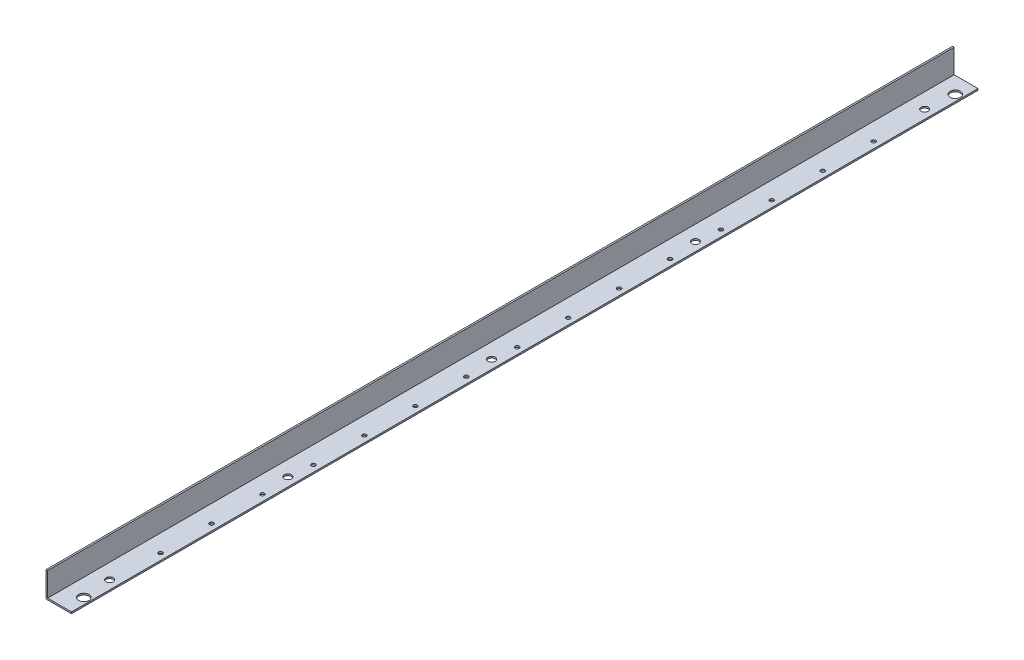
ISO-10303-21;
HEADER;
FILE_DESCRIPTION(('STEP AP214'),'2;1');
FILE_NAME('part.step','',(''),(''),'','','');
FILE_SCHEMA(('AUTOMOTIVE_DESIGN { 1 0 10303 214 1 1 1 1 }'));
ENDSEC;
DATA;
#1=APPLICATION_CONTEXT('core data for automotive mechanical design processes');
#2=APPLICATION_PROTOCOL_DEFINITION('international standard','automotive_design',2000,#1);
#3=PRODUCT_CONTEXT('',#1,'mechanical');
#4=PRODUCT('Part','Part','',(#3));
#5=PRODUCT_RELATED_PRODUCT_CATEGORY('part','',(#4));
#6=PRODUCT_DEFINITION_FORMATION('','',#4);
#7=PRODUCT_DEFINITION_CONTEXT('part definition',#1,'design');
#8=PRODUCT_DEFINITION('design','',#6,#7);
#9=PRODUCT_DEFINITION_SHAPE('','',#8);
#10=(LENGTH_UNIT() NAMED_UNIT(*) SI_UNIT(.MILLI.,.METRE.));
#11=(NAMED_UNIT(*) PLANE_ANGLE_UNIT() SI_UNIT($,.RADIAN.));
#12=(NAMED_UNIT(*) SI_UNIT($,.STERADIAN.) SOLID_ANGLE_UNIT());
#13=UNCERTAINTY_MEASURE_WITH_UNIT(LENGTH_MEASURE(1.E-05),#10,'distance_accuracy_value','');
#14=(GEOMETRIC_REPRESENTATION_CONTEXT(3) GLOBAL_UNCERTAINTY_ASSIGNED_CONTEXT((#13)) GLOBAL_UNIT_ASSIGNED_CONTEXT((#10,
#11,#12)) REPRESENTATION_CONTEXT('',''));
#15=CARTESIAN_POINT('',(0.,0.,0.));
#16=DIRECTION('',(0.,0.,1.));
#17=DIRECTION('',(1.,0.,0.));
#18=AXIS2_PLACEMENT_3D('',#15,#16,#17);
#19=CARTESIAN_POINT('',(38.1,0.,866.775));
#20=DIRECTION('',(0.,1.,0.));
#21=DIRECTION('',(0.,0.,1.));
#22=AXIS2_PLACEMENT_3D('',#19,#20,#21);
#23=CYLINDRICAL_SURFACE('',#22,10.31875);
#24=CARTESIAN_POINT('',(38.1,3.175,866.775));
#25=DIRECTION('',(0.,1.,0.));
#26=DIRECTION('',(0.,0.,1.));
#27=AXIS2_PLACEMENT_3D('',#24,#25,#26);
#28=CIRCLE('',#27,10.31875);
#29=CARTESIAN_POINT('',(38.1,3.175,877.09375));
#30=VERTEX_POINT('',#29);
#31=EDGE_CURVE('E19',#30,#30,#28,.F.);
#32=ORIENTED_EDGE('',*,*,#31,.F.);
#33=EDGE_LOOP('',(#32));
#34=FACE_BOUND('',#33,.T.);
#35=CARTESIAN_POINT('',(38.1,0.,866.775));
#36=DIRECTION('',(0.,1.,0.));
#37=DIRECTION('',(0.,0.,1.));
#38=AXIS2_PLACEMENT_3D('',#35,#36,#37);
#39=CIRCLE('',#38,10.31875);
#40=CARTESIAN_POINT('',(38.1,0.,877.09375));
#41=VERTEX_POINT('',#40);
#42=EDGE_CURVE('E100',#41,#41,#39,.T.);
#43=ORIENTED_EDGE('',*,*,#42,.F.);
#44=EDGE_LOOP('',(#43));
#45=FACE_BOUND('',#44,.T.);
#46=ADVANCED_FACE('F16',(#34,#45),#23,.F.);
#47=CARTESIAN_POINT('',(38.1,0.,-871.5375));
#48=DIRECTION('',(0.,1.,0.));
#49=DIRECTION('',(0.,0.,1.));
#50=AXIS2_PLACEMENT_3D('',#47,#48,#49);
#51=CYLINDRICAL_SURFACE('',#50,10.31875);
#52=CARTESIAN_POINT('',(38.1,3.175,-871.5375));
#53=DIRECTION('',(0.,1.,0.));
#54=DIRECTION('',(0.,0.,1.));
#55=AXIS2_PLACEMENT_3D('',#52,#53,#54);
#56=CIRCLE('',#55,10.31875);
#57=CARTESIAN_POINT('',(38.1,3.175,-861.21875));
#58=VERTEX_POINT('',#57);
#59=EDGE_CURVE('E222',#58,#58,#56,.F.);
#60=ORIENTED_EDGE('',*,*,#59,.F.);
#61=EDGE_LOOP('',(#60));
#62=FACE_BOUND('',#61,.T.);
#63=CARTESIAN_POINT('',(38.1,0.,-871.5375));
#64=DIRECTION('',(0.,1.,0.));
#65=DIRECTION('',(0.,0.,1.));
#66=AXIS2_PLACEMENT_3D('',#63,#64,#65);
#67=CIRCLE('',#66,10.31875);
#68=CARTESIAN_POINT('',(38.1,0.,-861.21875));
#69=VERTEX_POINT('',#68);
#70=EDGE_CURVE('E159',#69,#69,#67,.T.);
#71=ORIENTED_EDGE('',*,*,#70,.F.);
#72=EDGE_LOOP('',(#71));
#73=FACE_BOUND('',#72,.T.);
#74=ADVANCED_FACE('F232',(#62,#73),#51,.F.);
#75=CARTESIAN_POINT('',(33.3375,0.,810.41875));
#76=DIRECTION('',(0.,1.,0.));
#77=DIRECTION('',(0.,0.,1.));
#78=AXIS2_PLACEMENT_3D('',#75,#76,#77);
#79=CYLINDRICAL_SURFACE('',#78,7.14375);
#80=CARTESIAN_POINT('',(33.3375,3.175,810.41875));
#81=DIRECTION('',(0.,1.,0.));
#82=DIRECTION('',(0.,0.,1.));
#83=AXIS2_PLACEMENT_3D('',#80,#81,#82);
#84=CIRCLE('',#83,7.14375);
#85=CARTESIAN_POINT('',(33.3375,3.175,817.5625));
#86=VERTEX_POINT('',#85);
#87=EDGE_CURVE('E220',#86,#86,#84,.F.);
#88=ORIENTED_EDGE('',*,*,#87,.F.);
#89=EDGE_LOOP('',(#88));
#90=FACE_BOUND('',#89,.T.);
#91=CARTESIAN_POINT('',(33.3375,0.,810.41875));
#92=DIRECTION('',(0.,1.,0.));
#93=DIRECTION('',(0.,0.,1.));
#94=AXIS2_PLACEMENT_3D('',#91,#92,#93);
#95=CIRCLE('',#94,7.14375);
#96=CARTESIAN_POINT('',(33.3375,0.,817.5625));
#97=VERTEX_POINT('',#96);
#98=EDGE_CURVE('E156',#97,#97,#95,.T.);
#99=ORIENTED_EDGE('',*,*,#98,.F.);
#100=EDGE_LOOP('',(#99));
#101=FACE_BOUND('',#100,.T.);
#102=ADVANCED_FACE('F526',(#90,#101),#79,.F.);
#103=CARTESIAN_POINT('',(33.3375,0.,454.81875));
#104=DIRECTION('',(0.,1.,0.));
#105=DIRECTION('',(0.,0.,1.));
#106=AXIS2_PLACEMENT_3D('',#103,#104,#105);
#107=CYLINDRICAL_SURFACE('',#106,7.14375);
#108=CARTESIAN_POINT('',(33.3375,3.175,454.81875));
#109=DIRECTION('',(0.,1.,0.));
#110=DIRECTION('',(0.,0.,1.));
#111=AXIS2_PLACEMENT_3D('',#108,#109,#110);
#112=CIRCLE('',#111,7.14375);
#113=CARTESIAN_POINT('',(33.3375,3.175,461.9625));
#114=VERTEX_POINT('',#113);
#115=EDGE_CURVE('E217',#114,#114,#112,.F.);
#116=ORIENTED_EDGE('',*,*,#115,.F.);
#117=EDGE_LOOP('',(#116));
#118=FACE_BOUND('',#117,.T.);
#119=CARTESIAN_POINT('',(33.3375,0.,454.81875));
#120=DIRECTION('',(0.,1.,0.));
#121=DIRECTION('',(0.,0.,1.));
#122=AXIS2_PLACEMENT_3D('',#119,#120,#121);
#123=CIRCLE('',#122,7.14375);
#124=CARTESIAN_POINT('',(33.3375,0.,461.9625));
#125=VERTEX_POINT('',#124);
#126=EDGE_CURVE('E153',#125,#125,#123,.T.);
#127=ORIENTED_EDGE('',*,*,#126,.F.);
#128=EDGE_LOOP('',(#127));
#129=FACE_BOUND('',#128,.T.);
#130=ADVANCED_FACE('F516',(#118,#129),#107,.F.);
#131=CARTESIAN_POINT('',(33.3375,0.,48.64735));
#132=DIRECTION('',(0.,1.,0.));
#133=DIRECTION('',(0.,0.,1.));
#134=AXIS2_PLACEMENT_3D('',#131,#132,#133);
#135=CYLINDRICAL_SURFACE('',#134,7.14375);
#136=CARTESIAN_POINT('',(33.3375,3.175,48.64735));
#137=DIRECTION('',(0.,1.,0.));
#138=DIRECTION('',(0.,0.,1.));
#139=AXIS2_PLACEMENT_3D('',#136,#137,#138);
#140=CIRCLE('',#139,7.14375);
#141=CARTESIAN_POINT('',(33.3375,3.175,55.7911));
#142=VERTEX_POINT('',#141);
#143=EDGE_CURVE('E214',#142,#142,#140,.F.);
#144=ORIENTED_EDGE('',*,*,#143,.F.);
#145=EDGE_LOOP('',(#144));
#146=FACE_BOUND('',#145,.T.);
#147=CARTESIAN_POINT('',(33.3375,0.,48.64735));
#148=DIRECTION('',(0.,1.,0.));
#149=DIRECTION('',(0.,0.,1.));
#150=AXIS2_PLACEMENT_3D('',#147,#148,#149);
#151=CIRCLE('',#150,7.14375);
#152=CARTESIAN_POINT('',(33.3375,0.,55.7911));
#153=VERTEX_POINT('',#152);
#154=EDGE_CURVE('E150',#153,#153,#151,.T.);
#155=ORIENTED_EDGE('',*,*,#154,.F.);
#156=EDGE_LOOP('',(#155));
#157=FACE_BOUND('',#156,.T.);
#158=ADVANCED_FACE('F506',(#146,#157),#135,.F.);
#159=CARTESIAN_POINT('',(33.3375,0.,-357.98125));
#160=DIRECTION('',(0.,1.,0.));
#161=DIRECTION('',(0.,0.,1.));
#162=AXIS2_PLACEMENT_3D('',#159,#160,#161);
#163=CYLINDRICAL_SURFACE('',#162,7.14375);
#164=CARTESIAN_POINT('',(33.3375,3.175,-357.98125));
#165=DIRECTION('',(0.,1.,0.));
#166=DIRECTION('',(0.,0.,1.));
#167=AXIS2_PLACEMENT_3D('',#164,#165,#166);
#168=CIRCLE('',#167,7.14375);
#169=CARTESIAN_POINT('',(33.3375,3.175,-350.8375));
#170=VERTEX_POINT('',#169);
#171=EDGE_CURVE('E211',#170,#170,#168,.F.);
#172=ORIENTED_EDGE('',*,*,#171,.F.);
#173=EDGE_LOOP('',(#172));
#174=FACE_BOUND('',#173,.T.);
#175=CARTESIAN_POINT('',(33.3375,0.,-357.98125));
#176=DIRECTION('',(0.,1.,0.));
#177=DIRECTION('',(0.,0.,1.));
#178=AXIS2_PLACEMENT_3D('',#175,#176,#177);
#179=CIRCLE('',#178,7.14375);
#180=CARTESIAN_POINT('',(33.3375,0.,-350.8375));
#181=VERTEX_POINT('',#180);
#182=EDGE_CURVE('E147',#181,#181,#179,.T.);
#183=ORIENTED_EDGE('',*,*,#182,.F.);
#184=EDGE_LOOP('',(#183));
#185=FACE_BOUND('',#184,.T.);
#186=ADVANCED_FACE('F496',(#174,#185),#163,.F.);
#187=CARTESIAN_POINT('',(33.3375,0.,-815.18125));
#188=DIRECTION('',(0.,1.,0.));
#189=DIRECTION('',(0.,0.,1.));
#190=AXIS2_PLACEMENT_3D('',#187,#188,#189);
#191=CYLINDRICAL_SURFACE('',#190,7.14375);
#192=CARTESIAN_POINT('',(33.3375,3.175,-815.18125));
#193=DIRECTION('',(0.,1.,0.));
#194=DIRECTION('',(0.,0.,1.));
#195=AXIS2_PLACEMENT_3D('',#192,#193,#194);
#196=CIRCLE('',#195,7.14375);
#197=CARTESIAN_POINT('',(33.3375,3.175,-808.0375));
#198=VERTEX_POINT('',#197);
#199=EDGE_CURVE('E208',#198,#198,#196,.F.);
#200=ORIENTED_EDGE('',*,*,#199,.F.);
#201=EDGE_LOOP('',(#200));
#202=FACE_BOUND('',#201,.T.);
#203=CARTESIAN_POINT('',(33.3375,0.,-815.18125));
#204=DIRECTION('',(0.,1.,0.));
#205=DIRECTION('',(0.,0.,1.));
#206=AXIS2_PLACEMENT_3D('',#203,#204,#205);
#207=CIRCLE('',#206,7.14375);
#208=CARTESIAN_POINT('',(33.3375,0.,-808.0375));
#209=VERTEX_POINT('',#208);
#210=EDGE_CURVE('E144',#209,#209,#207,.T.);
#211=ORIENTED_EDGE('',*,*,#210,.F.);
#212=EDGE_LOOP('',(#211));
#213=FACE_BOUND('',#212,.T.);
#214=ADVANCED_FACE('F486',(#202,#213),#191,.F.);
#215=CARTESIAN_POINT('',(38.1,0.,-708.81875));
#216=DIRECTION('',(0.,-1.,0.));
#217=DIRECTION('',(0.,0.,-1.));
#218=AXIS2_PLACEMENT_3D('',#215,#216,#217);
#219=CYLINDRICAL_SURFACE('',#218,3.96875);
#220=CARTESIAN_POINT('',(38.1,3.175,-708.81875));
#221=DIRECTION('',(0.,-1.,0.));
#222=DIRECTION('',(0.,0.,-1.));
#223=AXIS2_PLACEMENT_3D('',#220,#221,#222);
#224=CIRCLE('',#223,3.96875);
#225=CARTESIAN_POINT('',(38.1,3.175,-712.7875));
#226=VERTEX_POINT('',#225);
#227=EDGE_CURVE('E205',#226,#226,#224,.T.);
#228=ORIENTED_EDGE('',*,*,#227,.F.);
#229=EDGE_LOOP('',(#228));
#230=FACE_BOUND('',#229,.T.);
#231=CARTESIAN_POINT('',(38.1,0.,-708.81875));
#232=DIRECTION('',(0.,-1.,0.));
#233=DIRECTION('',(0.,0.,-1.));
#234=AXIS2_PLACEMENT_3D('',#231,#232,#233);
#235=CIRCLE('',#234,3.96875);
#236=CARTESIAN_POINT('',(38.1,0.,-712.7875));
#237=VERTEX_POINT('',#236);
#238=EDGE_CURVE('E141',#237,#237,#235,.F.);
#239=ORIENTED_EDGE('',*,*,#238,.F.);
#240=EDGE_LOOP('',(#239));
#241=FACE_BOUND('',#240,.T.);
#242=ADVANCED_FACE('F476',(#230,#241),#219,.F.);
#243=CARTESIAN_POINT('',(38.1,0.,-607.21875));
#244=DIRECTION('',(0.,-1.,0.));
#245=DIRECTION('',(0.,0.,-1.));
#246=AXIS2_PLACEMENT_3D('',#243,#244,#245);
#247=CYLINDRICAL_SURFACE('',#246,3.96875);
#248=CARTESIAN_POINT('',(38.1,3.175,-607.21875));
#249=DIRECTION('',(0.,-1.,0.));
#250=DIRECTION('',(0.,0.,-1.));
#251=AXIS2_PLACEMENT_3D('',#248,#249,#250);
#252=CIRCLE('',#251,3.96875);
#253=CARTESIAN_POINT('',(38.1,3.175,-611.1875));
#254=VERTEX_POINT('',#253);
#255=EDGE_CURVE('E202',#254,#254,#252,.T.);
#256=ORIENTED_EDGE('',*,*,#255,.F.);
#257=EDGE_LOOP('',(#256));
#258=FACE_BOUND('',#257,.T.);
#259=CARTESIAN_POINT('',(38.1,0.,-607.21875));
#260=DIRECTION('',(0.,-1.,0.));
#261=DIRECTION('',(0.,0.,-1.));
#262=AXIS2_PLACEMENT_3D('',#259,#260,#261);
#263=CIRCLE('',#262,3.96875);
#264=CARTESIAN_POINT('',(38.1,0.,-611.1875));
#265=VERTEX_POINT('',#264);
#266=EDGE_CURVE('E138',#265,#265,#263,.F.);
#267=ORIENTED_EDGE('',*,*,#266,.F.);
#268=EDGE_LOOP('',(#267));
#269=FACE_BOUND('',#268,.T.);
#270=ADVANCED_FACE('F466',(#258,#269),#247,.F.);
#271=CARTESIAN_POINT('',(38.1,0.,-505.61875));
#272=DIRECTION('',(0.,-1.,0.));
#273=DIRECTION('',(0.,0.,-1.));
#274=AXIS2_PLACEMENT_3D('',#271,#272,#273);
#275=CYLINDRICAL_SURFACE('',#274,3.96875);
#276=CARTESIAN_POINT('',(38.1,3.175,-505.61875));
#277=DIRECTION('',(0.,-1.,0.));
#278=DIRECTION('',(0.,0.,-1.));
#279=AXIS2_PLACEMENT_3D('',#276,#277,#278);
#280=CIRCLE('',#279,3.96875);
#281=CARTESIAN_POINT('',(38.1,3.175,-509.5875));
#282=VERTEX_POINT('',#281);
#283=EDGE_CURVE('E199',#282,#282,#280,.T.);
#284=ORIENTED_EDGE('',*,*,#283,.F.);
#285=EDGE_LOOP('',(#284));
#286=FACE_BOUND('',#285,.T.);
#287=CARTESIAN_POINT('',(38.1,0.,-505.61875));
#288=DIRECTION('',(0.,-1.,0.));
#289=DIRECTION('',(0.,0.,-1.));
#290=AXIS2_PLACEMENT_3D('',#287,#288,#289);
#291=CIRCLE('',#290,3.96875);
#292=CARTESIAN_POINT('',(38.1,0.,-509.5875));
#293=VERTEX_POINT('',#292);
#294=EDGE_CURVE('E135',#293,#293,#291,.F.);
#295=ORIENTED_EDGE('',*,*,#294,.F.);
#296=EDGE_LOOP('',(#295));
#297=FACE_BOUND('',#296,.T.);
#298=ADVANCED_FACE('F456',(#286,#297),#275,.F.);
#299=CARTESIAN_POINT('',(38.1,0.,-404.01875));
#300=DIRECTION('',(0.,-1.,0.));
#301=DIRECTION('',(0.,0.,-1.));
#302=AXIS2_PLACEMENT_3D('',#299,#300,#301);
#303=CYLINDRICAL_SURFACE('',#302,3.96875);
#304=CARTESIAN_POINT('',(38.1,3.175,-404.01875));
#305=DIRECTION('',(0.,-1.,0.));
#306=DIRECTION('',(0.,0.,-1.));
#307=AXIS2_PLACEMENT_3D('',#304,#305,#306);
#308=CIRCLE('',#307,3.96875);
#309=CARTESIAN_POINT('',(38.1,3.175,-407.9875));
#310=VERTEX_POINT('',#309);
#311=EDGE_CURVE('E196',#310,#310,#308,.T.);
#312=ORIENTED_EDGE('',*,*,#311,.F.);
#313=EDGE_LOOP('',(#312));
#314=FACE_BOUND('',#313,.T.);
#315=CARTESIAN_POINT('',(38.1,0.,-404.01875));
#316=DIRECTION('',(0.,-1.,0.));
#317=DIRECTION('',(0.,0.,-1.));
#318=AXIS2_PLACEMENT_3D('',#315,#316,#317);
#319=CIRCLE('',#318,3.96875);
#320=CARTESIAN_POINT('',(38.1,0.,-407.9875));
#321=VERTEX_POINT('',#320);
#322=EDGE_CURVE('E132',#321,#321,#319,.F.);
#323=ORIENTED_EDGE('',*,*,#322,.F.);
#324=EDGE_LOOP('',(#323));
#325=FACE_BOUND('',#324,.T.);
#326=ADVANCED_FACE('F446',(#314,#325),#303,.F.);
#327=CARTESIAN_POINT('',(38.1,0.,-302.41875));
#328=DIRECTION('',(0.,-1.,0.));
#329=DIRECTION('',(0.,0.,-1.));
#330=AXIS2_PLACEMENT_3D('',#327,#328,#329);
#331=CYLINDRICAL_SURFACE('',#330,3.96875);
#332=CARTESIAN_POINT('',(38.1,3.175,-302.41875));
#333=DIRECTION('',(0.,-1.,0.));
#334=DIRECTION('',(0.,0.,-1.));
#335=AXIS2_PLACEMENT_3D('',#332,#333,#334);
#336=CIRCLE('',#335,3.96875);
#337=CARTESIAN_POINT('',(38.1,3.175,-306.3875));
#338=VERTEX_POINT('',#337);
#339=EDGE_CURVE('E193',#338,#338,#336,.T.);
#340=ORIENTED_EDGE('',*,*,#339,.F.);
#341=EDGE_LOOP('',(#340));
#342=FACE_BOUND('',#341,.T.);
#343=CARTESIAN_POINT('',(38.1,0.,-302.41875));
#344=DIRECTION('',(0.,-1.,0.));
#345=DIRECTION('',(0.,0.,-1.));
#346=AXIS2_PLACEMENT_3D('',#343,#344,#345);
#347=CIRCLE('',#346,3.96875);
#348=CARTESIAN_POINT('',(38.1,0.,-306.3875));
#349=VERTEX_POINT('',#348);
#350=EDGE_CURVE('E129',#349,#349,#347,.F.);
#351=ORIENTED_EDGE('',*,*,#350,.F.);
#352=EDGE_LOOP('',(#351));
#353=FACE_BOUND('',#352,.T.);
#354=ADVANCED_FACE('F436',(#342,#353),#331,.F.);
#355=CARTESIAN_POINT('',(38.1,0.,-200.81875));
#356=DIRECTION('',(0.,-1.,0.));
#357=DIRECTION('',(0.,0.,-1.));
#358=AXIS2_PLACEMENT_3D('',#355,#356,#357);
#359=CYLINDRICAL_SURFACE('',#358,3.96875);
#360=CARTESIAN_POINT('',(38.1,3.175,-200.81875));
#361=DIRECTION('',(0.,-1.,0.));
#362=DIRECTION('',(0.,0.,-1.));
#363=AXIS2_PLACEMENT_3D('',#360,#361,#362);
#364=CIRCLE('',#363,3.96875);
#365=CARTESIAN_POINT('',(38.1,3.175,-204.7875));
#366=VERTEX_POINT('',#365);
#367=EDGE_CURVE('E190',#366,#366,#364,.T.);
#368=ORIENTED_EDGE('',*,*,#367,.F.);
#369=EDGE_LOOP('',(#368));
#370=FACE_BOUND('',#369,.T.);
#371=CARTESIAN_POINT('',(38.1,0.,-200.81875));
#372=DIRECTION('',(0.,-1.,0.));
#373=DIRECTION('',(0.,0.,-1.));
#374=AXIS2_PLACEMENT_3D('',#371,#372,#373);
#375=CIRCLE('',#374,3.96875);
#376=CARTESIAN_POINT('',(38.1,0.,-204.7875));
#377=VERTEX_POINT('',#376);
#378=EDGE_CURVE('E126',#377,#377,#375,.F.);
#379=ORIENTED_EDGE('',*,*,#378,.F.);
#380=EDGE_LOOP('',(#379));
#381=FACE_BOUND('',#380,.T.);
#382=ADVANCED_FACE('F426',(#370,#381),#359,.F.);
#383=CARTESIAN_POINT('',(38.1,0.,-99.21875));
#384=DIRECTION('',(0.,-1.,0.));
#385=DIRECTION('',(0.,0.,-1.));
#386=AXIS2_PLACEMENT_3D('',#383,#384,#385);
#387=CYLINDRICAL_SURFACE('',#386,3.96875);
#388=CARTESIAN_POINT('',(38.1,3.175,-99.21875));
#389=DIRECTION('',(0.,-1.,0.));
#390=DIRECTION('',(0.,0.,-1.));
#391=AXIS2_PLACEMENT_3D('',#388,#389,#390);
#392=CIRCLE('',#391,3.96875);
#393=CARTESIAN_POINT('',(38.1,3.175,-103.1875));
#394=VERTEX_POINT('',#393);
#395=EDGE_CURVE('E187',#394,#394,#392,.T.);
#396=ORIENTED_EDGE('',*,*,#395,.F.);
#397=EDGE_LOOP('',(#396));
#398=FACE_BOUND('',#397,.T.);
#399=CARTESIAN_POINT('',(38.1,0.,-99.21875));
#400=DIRECTION('',(0.,-1.,0.));
#401=DIRECTION('',(0.,0.,-1.));
#402=AXIS2_PLACEMENT_3D('',#399,#400,#401);
#403=CIRCLE('',#402,3.96875);
#404=CARTESIAN_POINT('',(38.1,0.,-103.1875));
#405=VERTEX_POINT('',#404);
#406=EDGE_CURVE('E123',#405,#405,#403,.F.);
#407=ORIENTED_EDGE('',*,*,#406,.F.);
#408=EDGE_LOOP('',(#407));
#409=FACE_BOUND('',#408,.T.);
#410=ADVANCED_FACE('F416',(#398,#409),#387,.F.);
#411=CARTESIAN_POINT('',(38.1,0.,2.38125));
#412=DIRECTION('',(0.,-1.,0.));
#413=DIRECTION('',(0.,0.,-1.));
#414=AXIS2_PLACEMENT_3D('',#411,#412,#413);
#415=CYLINDRICAL_SURFACE('',#414,3.96875);
#416=CARTESIAN_POINT('',(38.1,3.175,2.38125));
#417=DIRECTION('',(0.,-1.,0.));
#418=DIRECTION('',(0.,0.,-1.));
#419=AXIS2_PLACEMENT_3D('',#416,#417,#418);
#420=CIRCLE('',#419,3.96875);
#421=CARTESIAN_POINT('',(38.1,3.175,-1.5875));
#422=VERTEX_POINT('',#421);
#423=EDGE_CURVE('E184',#422,#422,#420,.T.);
#424=ORIENTED_EDGE('',*,*,#423,.F.);
#425=EDGE_LOOP('',(#424));
#426=FACE_BOUND('',#425,.T.);
#427=CARTESIAN_POINT('',(38.1,0.,2.38125));
#428=DIRECTION('',(0.,-1.,0.));
#429=DIRECTION('',(0.,0.,-1.));
#430=AXIS2_PLACEMENT_3D('',#427,#428,#429);
#431=CIRCLE('',#430,3.96875);
#432=CARTESIAN_POINT('',(38.1,0.,-1.5875));
#433=VERTEX_POINT('',#432);
#434=EDGE_CURVE('E120',#433,#433,#431,.F.);
#435=ORIENTED_EDGE('',*,*,#434,.F.);
#436=EDGE_LOOP('',(#435));
#437=FACE_BOUND('',#436,.T.);
#438=ADVANCED_FACE('F406',(#426,#437),#415,.F.);
#439=CARTESIAN_POINT('',(38.1,0.,103.98125));
#440=DIRECTION('',(0.,-1.,0.));
#441=DIRECTION('',(0.,0.,-1.));
#442=AXIS2_PLACEMENT_3D('',#439,#440,#441);
#443=CYLINDRICAL_SURFACE('',#442,3.96875);
#444=CARTESIAN_POINT('',(38.1,3.175,103.98125));
#445=DIRECTION('',(0.,-1.,0.));
#446=DIRECTION('',(0.,0.,-1.));
#447=AXIS2_PLACEMENT_3D('',#444,#445,#446);
#448=CIRCLE('',#447,3.96875);
#449=CARTESIAN_POINT('',(38.1,3.175,100.0125));
#450=VERTEX_POINT('',#449);
#451=EDGE_CURVE('E181',#450,#450,#448,.T.);
#452=ORIENTED_EDGE('',*,*,#451,.F.);
#453=EDGE_LOOP('',(#452));
#454=FACE_BOUND('',#453,.T.);
#455=CARTESIAN_POINT('',(38.1,0.,103.98125));
#456=DIRECTION('',(0.,-1.,0.));
#457=DIRECTION('',(0.,0.,-1.));
#458=AXIS2_PLACEMENT_3D('',#455,#456,#457);
#459=CIRCLE('',#458,3.96875);
#460=CARTESIAN_POINT('',(38.1,0.,100.0125));
#461=VERTEX_POINT('',#460);
#462=EDGE_CURVE('E117',#461,#461,#459,.F.);
#463=ORIENTED_EDGE('',*,*,#462,.F.);
#464=EDGE_LOOP('',(#463));
#465=FACE_BOUND('',#464,.T.);
#466=ADVANCED_FACE('F396',(#454,#465),#443,.F.);
#467=CARTESIAN_POINT('',(38.1,0.,205.58125));
#468=DIRECTION('',(0.,-1.,0.));
#469=DIRECTION('',(0.,0.,-1.));
#470=AXIS2_PLACEMENT_3D('',#467,#468,#469);
#471=CYLINDRICAL_SURFACE('',#470,3.96875);
#472=CARTESIAN_POINT('',(38.1,3.175,205.58125));
#473=DIRECTION('',(0.,-1.,0.));
#474=DIRECTION('',(0.,0.,-1.));
#475=AXIS2_PLACEMENT_3D('',#472,#473,#474);
#476=CIRCLE('',#475,3.96875);
#477=CARTESIAN_POINT('',(38.1,3.175,201.6125));
#478=VERTEX_POINT('',#477);
#479=EDGE_CURVE('E178',#478,#478,#476,.T.);
#480=ORIENTED_EDGE('',*,*,#479,.F.);
#481=EDGE_LOOP('',(#480));
#482=FACE_BOUND('',#481,.T.);
#483=CARTESIAN_POINT('',(38.1,0.,205.58125));
#484=DIRECTION('',(0.,-1.,0.));
#485=DIRECTION('',(0.,0.,-1.));
#486=AXIS2_PLACEMENT_3D('',#483,#484,#485);
#487=CIRCLE('',#486,3.96875);
#488=CARTESIAN_POINT('',(38.1,0.,201.6125));
#489=VERTEX_POINT('',#488);
#490=EDGE_CURVE('E114',#489,#489,#487,.F.);
#491=ORIENTED_EDGE('',*,*,#490,.F.);
#492=EDGE_LOOP('',(#491));
#493=FACE_BOUND('',#492,.T.);
#494=ADVANCED_FACE('F386',(#482,#493),#471,.F.);
#495=CARTESIAN_POINT('',(38.1,0.,307.18125));
#496=DIRECTION('',(0.,-1.,0.));
#497=DIRECTION('',(0.,0.,-1.));
#498=AXIS2_PLACEMENT_3D('',#495,#496,#497);
#499=CYLINDRICAL_SURFACE('',#498,3.96875);
#500=CARTESIAN_POINT('',(38.1,3.175,307.18125));
#501=DIRECTION('',(0.,-1.,0.));
#502=DIRECTION('',(0.,0.,-1.));
#503=AXIS2_PLACEMENT_3D('',#500,#501,#502);
#504=CIRCLE('',#503,3.96875);
#505=CARTESIAN_POINT('',(38.1,3.175,303.2125));
#506=VERTEX_POINT('',#505);
#507=EDGE_CURVE('E175',#506,#506,#504,.T.);
#508=ORIENTED_EDGE('',*,*,#507,.F.);
#509=EDGE_LOOP('',(#508));
#510=FACE_BOUND('',#509,.T.);
#511=CARTESIAN_POINT('',(38.1,0.,307.18125));
#512=DIRECTION('',(0.,-1.,0.));
#513=DIRECTION('',(0.,0.,-1.));
#514=AXIS2_PLACEMENT_3D('',#511,#512,#513);
#515=CIRCLE('',#514,3.96875);
#516=CARTESIAN_POINT('',(38.1,0.,303.2125));
#517=VERTEX_POINT('',#516);
#518=EDGE_CURVE('E111',#517,#517,#515,.F.);
#519=ORIENTED_EDGE('',*,*,#518,.F.);
#520=EDGE_LOOP('',(#519));
#521=FACE_BOUND('',#520,.T.);
#522=ADVANCED_FACE('F376',(#510,#521),#499,.F.);
#523=CARTESIAN_POINT('',(38.1,0.,408.78125));
#524=DIRECTION('',(0.,-1.,0.));
#525=DIRECTION('',(0.,0.,-1.));
#526=AXIS2_PLACEMENT_3D('',#523,#524,#525);
#527=CYLINDRICAL_SURFACE('',#526,3.96875);
#528=CARTESIAN_POINT('',(38.1,3.175,408.78125));
#529=DIRECTION('',(0.,-1.,0.));
#530=DIRECTION('',(0.,0.,-1.));
#531=AXIS2_PLACEMENT_3D('',#528,#529,#530);
#532=CIRCLE('',#531,3.96875);
#533=CARTESIAN_POINT('',(38.1,3.175,404.8125));
#534=VERTEX_POINT('',#533);
#535=EDGE_CURVE('E172',#534,#534,#532,.T.);
#536=ORIENTED_EDGE('',*,*,#535,.F.);
#537=EDGE_LOOP('',(#536));
#538=FACE_BOUND('',#537,.T.);
#539=CARTESIAN_POINT('',(38.1,0.,408.78125));
#540=DIRECTION('',(0.,-1.,0.));
#541=DIRECTION('',(0.,0.,-1.));
#542=AXIS2_PLACEMENT_3D('',#539,#540,#541);
#543=CIRCLE('',#542,3.96875);
#544=CARTESIAN_POINT('',(38.1,0.,404.8125));
#545=VERTEX_POINT('',#544);
#546=EDGE_CURVE('E108',#545,#545,#543,.F.);
#547=ORIENTED_EDGE('',*,*,#546,.F.);
#548=EDGE_LOOP('',(#547));
#549=FACE_BOUND('',#548,.T.);
#550=ADVANCED_FACE('F366',(#538,#549),#527,.F.);
#551=CARTESIAN_POINT('',(38.1,0.,510.38125));
#552=DIRECTION('',(0.,-1.,0.));
#553=DIRECTION('',(0.,0.,-1.));
#554=AXIS2_PLACEMENT_3D('',#551,#552,#553);
#555=CYLINDRICAL_SURFACE('',#554,3.96875);
#556=CARTESIAN_POINT('',(38.1,3.175,510.38125));
#557=DIRECTION('',(0.,-1.,0.));
#558=DIRECTION('',(0.,0.,-1.));
#559=AXIS2_PLACEMENT_3D('',#556,#557,#558);
#560=CIRCLE('',#559,3.96875);
#561=CARTESIAN_POINT('',(38.1,3.175,506.4125));
#562=VERTEX_POINT('',#561);
#563=EDGE_CURVE('E169',#562,#562,#560,.T.);
#564=ORIENTED_EDGE('',*,*,#563,.F.);
#565=EDGE_LOOP('',(#564));
#566=FACE_BOUND('',#565,.T.);
#567=CARTESIAN_POINT('',(38.1,0.,510.38125));
#568=DIRECTION('',(0.,-1.,0.));
#569=DIRECTION('',(0.,0.,-1.));
#570=AXIS2_PLACEMENT_3D('',#567,#568,#569);
#571=CIRCLE('',#570,3.96875);
#572=CARTESIAN_POINT('',(38.1,0.,506.4125));
#573=VERTEX_POINT('',#572);
#574=EDGE_CURVE('E105',#573,#573,#571,.F.);
#575=ORIENTED_EDGE('',*,*,#574,.F.);
#576=EDGE_LOOP('',(#575));
#577=FACE_BOUND('',#576,.T.);
#578=ADVANCED_FACE('F356',(#566,#577),#555,.F.);
#579=CARTESIAN_POINT('',(38.1,0.,611.98125));
#580=DIRECTION('',(0.,-1.,0.));
#581=DIRECTION('',(0.,0.,-1.));
#582=AXIS2_PLACEMENT_3D('',#579,#580,#581);
#583=CYLINDRICAL_SURFACE('',#582,3.96875);
#584=CARTESIAN_POINT('',(38.1,3.175,611.98125));
#585=DIRECTION('',(0.,-1.,0.));
#586=DIRECTION('',(0.,0.,-1.));
#587=AXIS2_PLACEMENT_3D('',#584,#585,#586);
#588=CIRCLE('',#587,3.96875);
#589=CARTESIAN_POINT('',(38.1,3.175,608.0125));
#590=VERTEX_POINT('',#589);
#591=EDGE_CURVE('E166',#590,#590,#588,.T.);
#592=ORIENTED_EDGE('',*,*,#591,.F.);
#593=EDGE_LOOP('',(#592));
#594=FACE_BOUND('',#593,.T.);
#595=CARTESIAN_POINT('',(38.1,0.,611.98125));
#596=DIRECTION('',(0.,-1.,0.));
#597=DIRECTION('',(0.,0.,-1.));
#598=AXIS2_PLACEMENT_3D('',#595,#596,#597);
#599=CIRCLE('',#598,3.96875);
#600=CARTESIAN_POINT('',(38.1,0.,608.0125));
#601=VERTEX_POINT('',#600);
#602=EDGE_CURVE('E94',#601,#601,#599,.F.);
#603=ORIENTED_EDGE('',*,*,#602,.F.);
#604=EDGE_LOOP('',(#603));
#605=FACE_BOUND('',#604,.T.);
#606=ADVANCED_FACE('F346',(#594,#605),#583,.F.);
#607=CARTESIAN_POINT('',(38.1,0.,713.58125));
#608=DIRECTION('',(0.,-1.,0.));
#609=DIRECTION('',(0.,0.,-1.));
#610=AXIS2_PLACEMENT_3D('',#607,#608,#609);
#611=CYLINDRICAL_SURFACE('',#610,3.96875);
#612=CARTESIAN_POINT('',(38.1,3.175,713.58125));
#613=DIRECTION('',(0.,-1.,0.));
#614=DIRECTION('',(0.,0.,-1.));
#615=AXIS2_PLACEMENT_3D('',#612,#613,#614);
#616=CIRCLE('',#615,3.96875);
#617=CARTESIAN_POINT('',(38.1,3.175,709.6125));
#618=VERTEX_POINT('',#617);
#619=EDGE_CURVE('E101',#618,#618,#616,.T.);
#620=ORIENTED_EDGE('',*,*,#619,.F.);
#621=EDGE_LOOP('',(#620));
#622=FACE_BOUND('',#621,.T.);
#623=CARTESIAN_POINT('',(38.1,0.,713.58125));
#624=DIRECTION('',(0.,-1.,0.));
#625=DIRECTION('',(0.,0.,-1.));
#626=AXIS2_PLACEMENT_3D('',#623,#624,#625);
#627=CIRCLE('',#626,3.96875);
#628=CARTESIAN_POINT('',(38.1,0.,709.6125));
#629=VERTEX_POINT('',#628);
#630=EDGE_CURVE('E91',#629,#629,#627,.F.);
#631=ORIENTED_EDGE('',*,*,#630,.F.);
#632=EDGE_LOOP('',(#631));
#633=FACE_BOUND('',#632,.T.);
#634=ADVANCED_FACE('F337',(#622,#633),#611,.F.);
#635=CARTESIAN_POINT('',(50.8,0.,-904.08125));
#636=DIRECTION('',(1.,0.,0.));
#637=DIRECTION('',(0.,0.,-1.));
#638=AXIS2_PLACEMENT_3D('',#635,#636,#637);
#639=PLANE('',#638);
#640=DIRECTION('',(0.,0.,-1.));
#641=VECTOR('',#640,1.);
#642=CARTESIAN_POINT('',(50.8,0.,-904.08125));
#643=LINE('',#642,#641);
#644=CARTESIAN_POINT('',(50.8,0.,-904.08125));
#645=VERTEX_POINT('',#644);
#646=CARTESIAN_POINT('',(50.8,0.,904.08125));
#647=VERTEX_POINT('',#646);
#648=EDGE_CURVE('E98',#645,#647,#643,.F.);
#649=ORIENTED_EDGE('',*,*,#648,.F.);
#650=DIRECTION('',(0.,1.,0.));
#651=VECTOR('',#650,1.);
#652=CARTESIAN_POINT('',(50.8,0.,-904.08125));
#653=LINE('',#652,#651);
#654=CARTESIAN_POINT('',(50.8,3.175,-904.08125));
#655=VERTEX_POINT('',#654);
#656=EDGE_CURVE('E74',#645,#655,#653,.T.);
#657=ORIENTED_EDGE('',*,*,#656,.T.);
#658=DIRECTION('',(0.,0.,1.));
#659=VECTOR('',#658,1.);
#660=CARTESIAN_POINT('',(50.8,3.175,-904.08125));
#661=LINE('',#660,#659);
#662=CARTESIAN_POINT('',(50.8,3.175,904.08125));
#663=VERTEX_POINT('',#662);
#664=EDGE_CURVE('E70',#663,#655,#661,.F.);
#665=ORIENTED_EDGE('',*,*,#664,.F.);
#666=DIRECTION('',(0.,1.,0.));
#667=VECTOR('',#666,1.);
#668=CARTESIAN_POINT('',(50.8,0.,904.08125));
#669=LINE('',#668,#667);
#670=EDGE_CURVE('E67',#647,#663,#669,.T.);
#671=ORIENTED_EDGE('',*,*,#670,.F.);
#672=EDGE_LOOP('',(#649,#657,#665,#671));
#673=FACE_BOUND('',#672,.T.);
#674=ADVANCED_FACE('F72',(#673),#639,.T.);
#675=CARTESIAN_POINT('',(50.8,3.175,-904.08125));
#676=DIRECTION('',(0.,1.,0.));
#677=DIRECTION('',(0.,0.,1.));
#678=AXIS2_PLACEMENT_3D('',#675,#676,#677);
#679=PLANE('',#678);
#680=ORIENTED_EDGE('',*,*,#619,.T.);
#681=EDGE_LOOP('',(#680));
#682=FACE_BOUND('',#681,.T.);
#683=ORIENTED_EDGE('',*,*,#591,.T.);
#684=EDGE_LOOP('',(#683));
#685=FACE_BOUND('',#684,.T.);
#686=ORIENTED_EDGE('',*,*,#563,.T.);
#687=EDGE_LOOP('',(#686));
#688=FACE_BOUND('',#687,.T.);
#689=ORIENTED_EDGE('',*,*,#535,.T.);
#690=EDGE_LOOP('',(#689));
#691=FACE_BOUND('',#690,.T.);
#692=ORIENTED_EDGE('',*,*,#507,.T.);
#693=EDGE_LOOP('',(#692));
#694=FACE_BOUND('',#693,.T.);
#695=ORIENTED_EDGE('',*,*,#479,.T.);
#696=EDGE_LOOP('',(#695));
#697=FACE_BOUND('',#696,.T.);
#698=ORIENTED_EDGE('',*,*,#451,.T.);
#699=EDGE_LOOP('',(#698));
#700=FACE_BOUND('',#699,.T.);
#701=ORIENTED_EDGE('',*,*,#423,.T.);
#702=EDGE_LOOP('',(#701));
#703=FACE_BOUND('',#702,.T.);
#704=ORIENTED_EDGE('',*,*,#395,.T.);
#705=EDGE_LOOP('',(#704));
#706=FACE_BOUND('',#705,.T.);
#707=ORIENTED_EDGE('',*,*,#367,.T.);
#708=EDGE_LOOP('',(#707));
#709=FACE_BOUND('',#708,.T.);
#710=ORIENTED_EDGE('',*,*,#339,.T.);
#711=EDGE_LOOP('',(#710));
#712=FACE_BOUND('',#711,.T.);
#713=ORIENTED_EDGE('',*,*,#311,.T.);
#714=EDGE_LOOP('',(#713));
#715=FACE_BOUND('',#714,.T.);
#716=ORIENTED_EDGE('',*,*,#283,.T.);
#717=EDGE_LOOP('',(#716));
#718=FACE_BOUND('',#717,.T.);
#719=ORIENTED_EDGE('',*,*,#255,.T.);
#720=EDGE_LOOP('',(#719));
#721=FACE_BOUND('',#720,.T.);
#722=ORIENTED_EDGE('',*,*,#227,.T.);
#723=EDGE_LOOP('',(#722));
#724=FACE_BOUND('',#723,.T.);
#725=ORIENTED_EDGE('',*,*,#199,.T.);
#726=EDGE_LOOP('',(#725));
#727=FACE_BOUND('',#726,.T.);
#728=ORIENTED_EDGE('',*,*,#171,.T.);
#729=EDGE_LOOP('',(#728));
#730=FACE_BOUND('',#729,.T.);
#731=ORIENTED_EDGE('',*,*,#143,.T.);
#732=EDGE_LOOP('',(#731));
#733=FACE_BOUND('',#732,.T.);
#734=ORIENTED_EDGE('',*,*,#115,.T.);
#735=EDGE_LOOP('',(#734));
#736=FACE_BOUND('',#735,.T.);
#737=ORIENTED_EDGE('',*,*,#87,.T.);
#738=EDGE_LOOP('',(#737));
#739=FACE_BOUND('',#738,.T.);
#740=ORIENTED_EDGE('',*,*,#59,.T.);
#741=EDGE_LOOP('',(#740));
#742=FACE_BOUND('',#741,.T.);
#743=ORIENTED_EDGE('',*,*,#31,.T.);
#744=EDGE_LOOP('',(#743));
#745=FACE_BOUND('',#744,.T.);
#746=ORIENTED_EDGE('',*,*,#664,.T.);
#747=DIRECTION('',(1.,0.,0.));
#748=VECTOR('',#747,1.);
#749=CARTESIAN_POINT('',(0.,3.175,-904.08125));
#750=LINE('',#749,#748);
#751=CARTESIAN_POINT('',(3.175,3.175,-904.08125));
#752=VERTEX_POINT('',#751);
#753=EDGE_CURVE('E263',#655,#752,#750,.F.);
#754=ORIENTED_EDGE('',*,*,#753,.T.);
#755=DIRECTION('',(0.,0.,-1.));
#756=VECTOR('',#755,1.);
#757=CARTESIAN_POINT('',(3.175,3.175,-904.08125));
#758=LINE('',#757,#756);
#759=CARTESIAN_POINT('',(3.175,3.175,904.08125));
#760=VERTEX_POINT('',#759);
#761=EDGE_CURVE('E82',#760,#752,#758,.T.);
#762=ORIENTED_EDGE('',*,*,#761,.F.);
#763=DIRECTION('',(1.,0.,0.));
#764=VECTOR('',#763,1.);
#765=CARTESIAN_POINT('',(0.,3.175,904.08125));
#766=LINE('',#765,#764);
#767=EDGE_CURVE('E79',#663,#760,#766,.F.);
#768=ORIENTED_EDGE('',*,*,#767,.F.);
#769=EDGE_LOOP('',(#746,#754,#762,#768));
#770=FACE_BOUND('',#769,.T.);
#771=ADVANCED_FACE('F80',(#682,#685,#688,#691,#694,#697,#700,#703,#706,#709,#712,#715,#718,#721,
#724,#727,#730,#733,#736,#739,#742,#745,#770),#679,.T.);
#772=CARTESIAN_POINT('',(3.175,3.175,-904.08125));
#773=DIRECTION('',(1.,0.,0.));
#774=DIRECTION('',(0.,0.,-1.));
#775=AXIS2_PLACEMENT_3D('',#772,#773,#774);
#776=PLANE('',#775);
#777=ORIENTED_EDGE('',*,*,#761,.T.);
#778=DIRECTION('',(0.,1.,0.));
#779=VECTOR('',#778,1.);
#780=CARTESIAN_POINT('',(3.175,0.,-904.08125));
#781=LINE('',#780,#779);
#782=CARTESIAN_POINT('',(3.175,50.8,-904.08125));
#783=VERTEX_POINT('',#782);
#784=EDGE_CURVE('E261',#752,#783,#781,.T.);
#785=ORIENTED_EDGE('',*,*,#784,.T.);
#786=DIRECTION('',(0.,0.,1.));
#787=VECTOR('',#786,1.);
#788=CARTESIAN_POINT('',(3.175,50.8,-904.08125));
#789=LINE('',#788,#787);
#790=CARTESIAN_POINT('',(3.175,50.8,904.08125));
#791=VERTEX_POINT('',#790);
#792=EDGE_CURVE('E253',#791,#783,#789,.F.);
#793=ORIENTED_EDGE('',*,*,#792,.F.);
#794=DIRECTION('',(0.,1.,0.));
#795=VECTOR('',#794,1.);
#796=CARTESIAN_POINT('',(3.175,0.,904.08125));
#797=LINE('',#796,#795);
#798=EDGE_CURVE('E85',#760,#791,#797,.T.);
#799=ORIENTED_EDGE('',*,*,#798,.F.);
#800=EDGE_LOOP('',(#777,#785,#793,#799));
#801=FACE_BOUND('',#800,.T.);
#802=ADVANCED_FACE('F238',(#801),#776,.T.);
#803=CARTESIAN_POINT('',(0.,0.,-904.08125));
#804=DIRECTION('',(0.,-1.,0.));
#805=DIRECTION('',(0.,0.,-1.));
#806=AXIS2_PLACEMENT_3D('',#803,#804,#805);
#807=PLANE('',#806);
#808=ORIENTED_EDGE('',*,*,#630,.T.);
#809=EDGE_LOOP('',(#808));
#810=FACE_BOUND('',#809,.T.);
#811=ORIENTED_EDGE('',*,*,#602,.T.);
#812=EDGE_LOOP('',(#811));
#813=FACE_BOUND('',#812,.T.);
#814=ORIENTED_EDGE('',*,*,#574,.T.);
#815=EDGE_LOOP('',(#814));
#816=FACE_BOUND('',#815,.T.);
#817=ORIENTED_EDGE('',*,*,#546,.T.);
#818=EDGE_LOOP('',(#817));
#819=FACE_BOUND('',#818,.T.);
#820=ORIENTED_EDGE('',*,*,#518,.T.);
#821=EDGE_LOOP('',(#820));
#822=FACE_BOUND('',#821,.T.);
#823=ORIENTED_EDGE('',*,*,#490,.T.);
#824=EDGE_LOOP('',(#823));
#825=FACE_BOUND('',#824,.T.);
#826=ORIENTED_EDGE('',*,*,#462,.T.);
#827=EDGE_LOOP('',(#826));
#828=FACE_BOUND('',#827,.T.);
#829=ORIENTED_EDGE('',*,*,#434,.T.);
#830=EDGE_LOOP('',(#829));
#831=FACE_BOUND('',#830,.T.);
#832=ORIENTED_EDGE('',*,*,#406,.T.);
#833=EDGE_LOOP('',(#832));
#834=FACE_BOUND('',#833,.T.);
#835=ORIENTED_EDGE('',*,*,#378,.T.);
#836=EDGE_LOOP('',(#835));
#837=FACE_BOUND('',#836,.T.);
#838=ORIENTED_EDGE('',*,*,#350,.T.);
#839=EDGE_LOOP('',(#838));
#840=FACE_BOUND('',#839,.T.);
#841=ORIENTED_EDGE('',*,*,#322,.T.);
#842=EDGE_LOOP('',(#841));
#843=FACE_BOUND('',#842,.T.);
#844=ORIENTED_EDGE('',*,*,#294,.T.);
#845=EDGE_LOOP('',(#844));
#846=FACE_BOUND('',#845,.T.);
#847=ORIENTED_EDGE('',*,*,#266,.T.);
#848=EDGE_LOOP('',(#847));
#849=FACE_BOUND('',#848,.T.);
#850=ORIENTED_EDGE('',*,*,#238,.T.);
#851=EDGE_LOOP('',(#850));
#852=FACE_BOUND('',#851,.T.);
#853=ORIENTED_EDGE('',*,*,#210,.T.);
#854=EDGE_LOOP('',(#853));
#855=FACE_BOUND('',#854,.T.);
#856=ORIENTED_EDGE('',*,*,#182,.T.);
#857=EDGE_LOOP('',(#856));
#858=FACE_BOUND('',#857,.T.);
#859=ORIENTED_EDGE('',*,*,#154,.T.);
#860=EDGE_LOOP('',(#859));
#861=FACE_BOUND('',#860,.T.);
#862=ORIENTED_EDGE('',*,*,#126,.T.);
#863=EDGE_LOOP('',(#862));
#864=FACE_BOUND('',#863,.T.);
#865=ORIENTED_EDGE('',*,*,#98,.T.);
#866=EDGE_LOOP('',(#865));
#867=FACE_BOUND('',#866,.T.);
#868=ORIENTED_EDGE('',*,*,#70,.T.);
#869=EDGE_LOOP('',(#868));
#870=FACE_BOUND('',#869,.T.);
#871=ORIENTED_EDGE('',*,*,#42,.T.);
#872=EDGE_LOOP('',(#871));
#873=FACE_BOUND('',#872,.T.);
#874=DIRECTION('',(0.,0.,1.));
#875=VECTOR('',#874,1.);
#876=CARTESIAN_POINT('',(0.,0.,-904.08125));
#877=LINE('',#876,#875);
#878=CARTESIAN_POINT('',(0.,0.,-904.08125));
#879=VERTEX_POINT('',#878);
#880=CARTESIAN_POINT('',(0.,0.,904.08125));
#881=VERTEX_POINT('',#880);
#882=EDGE_CURVE('E243',#879,#881,#877,.T.);
#883=ORIENTED_EDGE('',*,*,#882,.F.);
#884=DIRECTION('',(1.,0.,0.));
#885=VECTOR('',#884,1.);
#886=CARTESIAN_POINT('',(0.,0.,-904.08125));
#887=LINE('',#886,#885);
#888=EDGE_CURVE('E245',#879,#645,#887,.T.);
#889=ORIENTED_EDGE('',*,*,#888,.T.);
#890=ORIENTED_EDGE('',*,*,#648,.T.);
#891=DIRECTION('',(1.,0.,0.));
#892=VECTOR('',#891,1.);
#893=CARTESIAN_POINT('',(0.,0.,904.08125));
#894=LINE('',#893,#892);
#895=EDGE_CURVE('E90',#881,#647,#894,.T.);
#896=ORIENTED_EDGE('',*,*,#895,.F.);
#897=EDGE_LOOP('',(#883,#889,#890,#896));
#898=FACE_BOUND('',#897,.T.);
#899=ADVANCED_FACE('F235',(#810,#813,#816,#819,#822,#825,#828,#831,#834,#837,#840,#843,#846,
#849,#852,#855,#858,#861,#864,#867,#870,#873,#898),#807,.T.);
#900=CARTESIAN_POINT('',(0.,0.,904.08125));
#901=DIRECTION('',(0.,0.,1.));
#902=DIRECTION('',(1.,0.,0.));
#903=AXIS2_PLACEMENT_3D('',#900,#901,#902);
#904=PLANE('',#903);
#905=DIRECTION('',(0.,1.,0.));
#906=VECTOR('',#905,1.);
#907=CARTESIAN_POINT('',(0.,50.8,904.08125));
#908=LINE('',#907,#906);
#909=CARTESIAN_POINT('',(0.,50.8,904.08125));
#910=VERTEX_POINT('',#909);
#911=EDGE_CURVE('E248',#881,#910,#908,.T.);
#912=ORIENTED_EDGE('',*,*,#911,.F.);
#913=ORIENTED_EDGE('',*,*,#895,.T.);
#914=ORIENTED_EDGE('',*,*,#670,.T.);
#915=ORIENTED_EDGE('',*,*,#767,.T.);
#916=ORIENTED_EDGE('',*,*,#798,.T.);
#917=DIRECTION('',(1.,0.,0.));
#918=VECTOR('',#917,1.);
#919=CARTESIAN_POINT('',(3.175,50.8,904.08125));
#920=LINE('',#919,#918);
#921=EDGE_CURVE('E267',#910,#791,#920,.T.);
#922=ORIENTED_EDGE('',*,*,#921,.F.);
#923=EDGE_LOOP('',(#912,#913,#914,#915,#916,#922));
#924=FACE_BOUND('',#923,.T.);
#925=ADVANCED_FACE('F89',(#924),#904,.T.);
#926=CARTESIAN_POINT('',(3.175,50.8,-904.08125));
#927=DIRECTION('',(0.,1.,0.));
#928=DIRECTION('',(0.,0.,1.));
#929=AXIS2_PLACEMENT_3D('',#926,#927,#928);
#930=PLANE('',#929);
#931=ORIENTED_EDGE('',*,*,#792,.T.);
#932=DIRECTION('',(1.,0.,0.));
#933=VECTOR('',#932,1.);
#934=CARTESIAN_POINT('',(0.,50.8,-904.08125));
#935=LINE('',#934,#933);
#936=CARTESIAN_POINT('',(0.,50.8,-904.08125));
#937=VERTEX_POINT('',#936);
#938=EDGE_CURVE('E34',#783,#937,#935,.F.);
#939=ORIENTED_EDGE('',*,*,#938,.T.);
#940=DIRECTION('',(0.,0.,1.));
#941=VECTOR('',#940,1.);
#942=CARTESIAN_POINT('',(0.,50.8,-904.08125));
#943=LINE('',#942,#941);
#944=EDGE_CURVE('E25',#910,#937,#943,.F.);
#945=ORIENTED_EDGE('',*,*,#944,.F.);
#946=ORIENTED_EDGE('',*,*,#921,.T.);
#947=EDGE_LOOP('',(#931,#939,#945,#946));
#948=FACE_BOUND('',#947,.T.);
#949=ADVANCED_FACE('F272',(#948),#930,.T.);
#950=CARTESIAN_POINT('',(0.,0.,-904.08125));
#951=DIRECTION('',(0.,0.,1.));
#952=DIRECTION('',(1.,0.,0.));
#953=AXIS2_PLACEMENT_3D('',#950,#951,#952);
#954=PLANE('',#953);
#955=ORIENTED_EDGE('',*,*,#938,.F.);
#956=ORIENTED_EDGE('',*,*,#784,.F.);
#957=ORIENTED_EDGE('',*,*,#753,.F.);
#958=ORIENTED_EDGE('',*,*,#656,.F.);
#959=ORIENTED_EDGE('',*,*,#888,.F.);
#960=DIRECTION('',(0.,1.,0.));
#961=VECTOR('',#960,1.);
#962=CARTESIAN_POINT('',(0.,50.8,-904.08125));
#963=LINE('',#962,#961);
#964=EDGE_CURVE('E11',#937,#879,#963,.F.);
#965=ORIENTED_EDGE('',*,*,#964,.F.);
#966=EDGE_LOOP('',(#955,#956,#957,#958,#959,#965));
#967=FACE_BOUND('',#966,.T.);
#968=ADVANCED_FACE('F251',(#967),#954,.F.);
#969=CARTESIAN_POINT('',(0.,50.8,-904.08125));
#970=DIRECTION('',(-1.,0.,0.));
#971=DIRECTION('',(0.,0.,1.));
#972=AXIS2_PLACEMENT_3D('',#969,#970,#971);
#973=PLANE('',#972);
#974=ORIENTED_EDGE('',*,*,#944,.T.);
#975=ORIENTED_EDGE('',*,*,#964,.T.);
#976=ORIENTED_EDGE('',*,*,#882,.T.);
#977=ORIENTED_EDGE('',*,*,#911,.T.);
#978=EDGE_LOOP('',(#974,#975,#976,#977));
#979=FACE_BOUND('',#978,.T.);
#980=ADVANCED_FACE('F255',(#979),#973,.T.);
#981=CLOSED_SHELL('',(#46,#74,#102,#130,#158,#186,#214,#242,#270,#298,#326,#354,#382,#410,#438,
#466,#494,#522,#550,#578,#606,#634,#674,#771,#802,#899,#925,#949,#968,#980));
#982=MANIFOLD_SOLID_BREP('B1',#981);
#983=ADVANCED_BREP_SHAPE_REPRESENTATION('',(#18,#982),#14);
#984=SHAPE_DEFINITION_REPRESENTATION(#9,#983);
ENDSEC;
END-ISO-10303-21;
